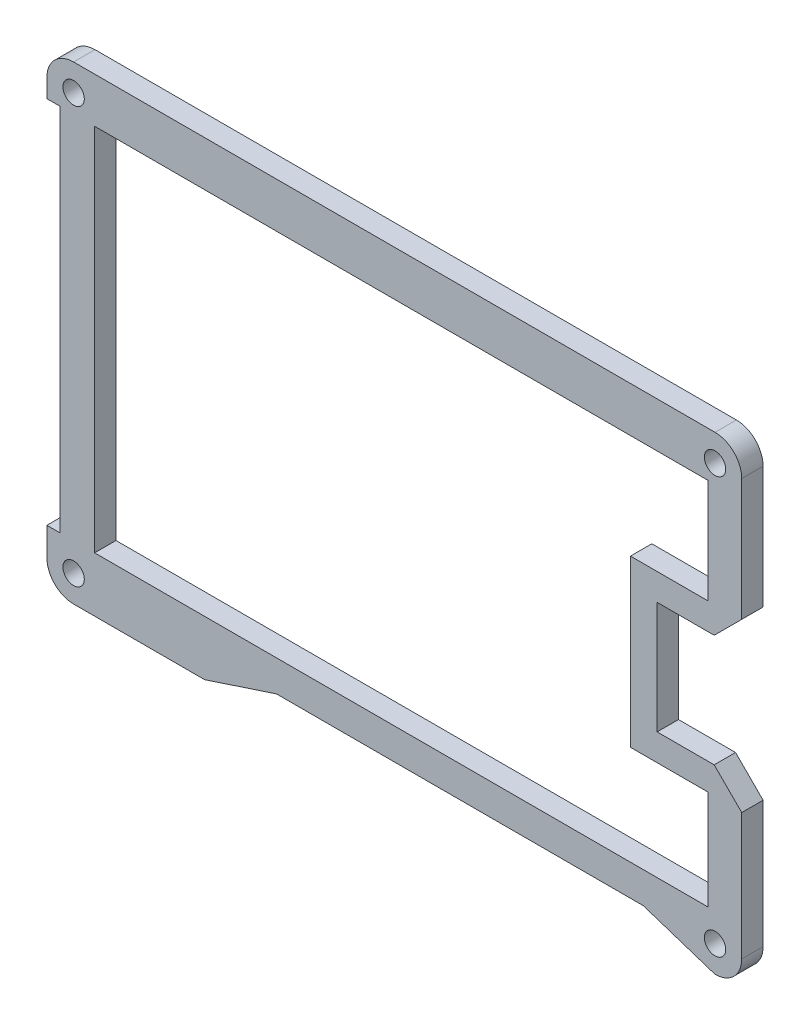
ISO-10303-21;
HEADER;
FILE_DESCRIPTION(('STEP AP214'),'2;1');
FILE_NAME('part.step','',(''),(''),'','','');
FILE_SCHEMA(('AUTOMOTIVE_DESIGN { 1 0 10303 214 1 1 1 1 }'));
ENDSEC;
DATA;
#1=APPLICATION_CONTEXT('core data for automotive mechanical design processes');
#2=APPLICATION_PROTOCOL_DEFINITION('international standard','automotive_design',2000,#1);
#3=PRODUCT_CONTEXT('',#1,'mechanical');
#4=PRODUCT('Part','Part','',(#3));
#5=PRODUCT_RELATED_PRODUCT_CATEGORY('part','',(#4));
#6=PRODUCT_DEFINITION_FORMATION('','',#4);
#7=PRODUCT_DEFINITION_CONTEXT('part definition',#1,'design');
#8=PRODUCT_DEFINITION('design','',#6,#7);
#9=PRODUCT_DEFINITION_SHAPE('','',#8);
#10=(LENGTH_UNIT() NAMED_UNIT(*) SI_UNIT(.MILLI.,.METRE.));
#11=(NAMED_UNIT(*) PLANE_ANGLE_UNIT() SI_UNIT($,.RADIAN.));
#12=(NAMED_UNIT(*) SI_UNIT($,.STERADIAN.) SOLID_ANGLE_UNIT());
#13=UNCERTAINTY_MEASURE_WITH_UNIT(LENGTH_MEASURE(1.E-05),#10,'distance_accuracy_value','');
#14=(GEOMETRIC_REPRESENTATION_CONTEXT(3) GLOBAL_UNCERTAINTY_ASSIGNED_CONTEXT((#13)) GLOBAL_UNIT_ASSIGNED_CONTEXT((#10,
#11,#12)) REPRESENTATION_CONTEXT('',''));
#15=CARTESIAN_POINT('',(0.,0.,0.));
#16=DIRECTION('',(0.,0.,1.));
#17=DIRECTION('',(1.,0.,0.));
#18=AXIS2_PLACEMENT_3D('',#15,#16,#17);
#19=CARTESIAN_POINT('',(-305.7573,91.6317,3.048));
#20=DIRECTION('',(0.,0.,1.));
#21=DIRECTION('',(1.,0.,0.));
#22=AXIS2_PLACEMENT_3D('',#19,#20,#21);
#23=PLANE('',#22);
#24=CARTESIAN_POINT('',(-305.7573,91.6317,3.048));
#25=DIRECTION('',(0.,0.,-1.));
#26=DIRECTION('',(-1.,0.,0.));
#27=AXIS2_PLACEMENT_3D('',#24,#25,#26);
#28=CIRCLE('',#27,1.52400000000001);
#29=CARTESIAN_POINT('',(-307.2813,91.6317,3.048));
#30=VERTEX_POINT('',#29);
#31=EDGE_CURVE('E331',#30,#30,#28,.T.);
#32=ORIENTED_EDGE('',*,*,#31,.T.);
#33=EDGE_LOOP('',(#32));
#34=FACE_BOUND('',#33,.T.);
#35=CARTESIAN_POINT('',(-397.2472,91.6317,3.048));
#36=DIRECTION('',(0.,0.,-1.));
#37=DIRECTION('',(-1.,0.,0.));
#38=AXIS2_PLACEMENT_3D('',#35,#36,#37);
#39=CIRCLE('',#38,1.52400000000001);
#40=CARTESIAN_POINT('',(-398.7712,91.6317,3.048));
#41=VERTEX_POINT('',#40);
#42=EDGE_CURVE('E337',#41,#41,#39,.T.);
#43=ORIENTED_EDGE('',*,*,#42,.T.);
#44=EDGE_LOOP('',(#43));
#45=FACE_BOUND('',#44,.T.);
#46=CARTESIAN_POINT('',(-397.247125,150.9704,3.048));
#47=DIRECTION('',(0.,0.,-1.));
#48=DIRECTION('',(-1.,0.,0.));
#49=AXIS2_PLACEMENT_3D('',#46,#47,#48);
#50=CIRCLE('',#49,1.52400000000001);
#51=CARTESIAN_POINT('',(-398.771125,150.9704,3.048));
#52=VERTEX_POINT('',#51);
#53=EDGE_CURVE('E343',#52,#52,#50,.T.);
#54=ORIENTED_EDGE('',*,*,#53,.T.);
#55=EDGE_LOOP('',(#54));
#56=FACE_BOUND('',#55,.T.);
#57=CARTESIAN_POINT('',(-305.7573,150.9704,3.048));
#58=DIRECTION('',(0.,0.,-1.));
#59=DIRECTION('',(-1.,0.,0.));
#60=AXIS2_PLACEMENT_3D('',#57,#58,#59);
#61=CIRCLE('',#60,1.52400000000001);
#62=CARTESIAN_POINT('',(-307.2813,150.9704,3.048));
#63=VERTEX_POINT('',#62);
#64=EDGE_CURVE('E349',#63,#63,#61,.T.);
#65=ORIENTED_EDGE('',*,*,#64,.T.);
#66=EDGE_LOOP('',(#65));
#67=FACE_BOUND('',#66,.T.);
#68=DIRECTION('',(0.,1.,0.));
#69=VECTOR('',#68,1.);
#70=CARTESIAN_POINT('',(-301.9473,91.6317,3.048));
#71=LINE('',#70,#69);
#72=CARTESIAN_POINT('',(-301.9473,91.6317,3.048));
#73=VERTEX_POINT('',#72);
#74=CARTESIAN_POINT('',(-301.9473,109.71445,3.048));
#75=VERTEX_POINT('',#74);
#76=EDGE_CURVE('E386',#73,#75,#71,.T.);
#77=ORIENTED_EDGE('',*,*,#76,.T.);
#78=DIRECTION('',(0.707106781186548,-0.707106781186548,0.));
#79=VECTOR('',#78,1.);
#80=CARTESIAN_POINT('',(-96.116425,-96.116425,3.048));
#81=LINE('',#80,#79);
#82=CARTESIAN_POINT('',(-305.87795,113.6451,3.048));
#83=VERTEX_POINT('',#82);
#84=EDGE_CURVE('E296',#83,#75,#81,.T.);
#85=ORIENTED_EDGE('',*,*,#84,.F.);
#86=DIRECTION('',(1.,0.,0.));
#87=VECTOR('',#86,1.);
#88=CARTESIAN_POINT('',(0.,113.6451,3.048));
#89=LINE('',#88,#87);
#90=CARTESIAN_POINT('',(-314.0123,113.6451,3.048));
#91=VERTEX_POINT('',#90);
#92=EDGE_CURVE('E311',#91,#83,#89,.T.);
#93=ORIENTED_EDGE('',*,*,#92,.F.);
#94=DIRECTION('',(0.,1.,0.));
#95=VECTOR('',#94,1.);
#96=CARTESIAN_POINT('',(-314.0123,128.8851,3.048));
#97=LINE('',#96,#95);
#98=CARTESIAN_POINT('',(-314.0123,129.6471,3.048));
#99=VERTEX_POINT('',#98);
#100=EDGE_CURVE('E388',#91,#99,#97,.T.);
#101=ORIENTED_EDGE('',*,*,#100,.T.);
#102=DIRECTION('',(-1.,0.,0.));
#103=VECTOR('',#102,1.);
#104=CARTESIAN_POINT('',(0.,129.6471,3.048));
#105=LINE('',#104,#103);
#106=CARTESIAN_POINT('',(-305.87795,129.6471,3.048));
#107=VERTEX_POINT('',#106);
#108=EDGE_CURVE('E308',#107,#99,#105,.T.);
#109=ORIENTED_EDGE('',*,*,#108,.F.);
#110=DIRECTION('',(-0.707106781186548,-0.707106781186548,0.));
#111=VECTOR('',#110,1.);
#112=CARTESIAN_POINT('',(-217.762525,217.762525,3.048));
#113=LINE('',#112,#111);
#114=CARTESIAN_POINT('',(-301.9473,133.57775,3.048));
#115=VERTEX_POINT('',#114);
#116=EDGE_CURVE('E280',#115,#107,#113,.T.);
#117=ORIENTED_EDGE('',*,*,#116,.F.);
#118=DIRECTION('',(0.,1.,0.));
#119=VECTOR('',#118,1.);
#120=CARTESIAN_POINT('',(-301.9473,132.81575,3.048));
#121=LINE('',#120,#119);
#122=CARTESIAN_POINT('',(-301.9473,150.9704,3.048));
#123=VERTEX_POINT('',#122);
#124=EDGE_CURVE('E355',#115,#123,#121,.T.);
#125=ORIENTED_EDGE('',*,*,#124,.T.);
#126=CARTESIAN_POINT('',(-305.7573,150.9704,3.048));
#127=DIRECTION('',(0.,0.,1.));
#128=DIRECTION('',(1.,0.,0.));
#129=AXIS2_PLACEMENT_3D('',#126,#127,#128);
#130=CIRCLE('',#129,3.80999999999997);
#131=CARTESIAN_POINT('',(-305.7573,154.7804,3.048));
#132=VERTEX_POINT('',#131);
#133=EDGE_CURVE('E357',#123,#132,#130,.T.);
#134=ORIENTED_EDGE('',*,*,#133,.T.);
#135=DIRECTION('',(-1.,0.,0.));
#136=VECTOR('',#135,1.);
#137=CARTESIAN_POINT('',(-305.7573,154.7804,3.048));
#138=LINE('',#137,#136);
#139=CARTESIAN_POINT('',(-397.247125,154.7804,3.048));
#140=VERTEX_POINT('',#139);
#141=EDGE_CURVE('E360',#132,#140,#138,.T.);
#142=ORIENTED_EDGE('',*,*,#141,.T.);
#143=CARTESIAN_POINT('',(-397.247125,150.9704,3.048));
#144=DIRECTION('',(0.,0.,1.));
#145=DIRECTION('',(1.,0.,0.));
#146=AXIS2_PLACEMENT_3D('',#143,#144,#145);
#147=CIRCLE('',#146,3.81000000000001);
#148=CARTESIAN_POINT('',(-401.0571,150.956597848903,3.048));
#149=VERTEX_POINT('',#148);
#150=EDGE_CURVE('E362',#140,#149,#147,.T.);
#151=ORIENTED_EDGE('',*,*,#150,.T.);
#152=DIRECTION('',(0.,-1.,0.));
#153=VECTOR('',#152,1.);
#154=CARTESIAN_POINT('',(-401.0571,150.956597848903,3.048));
#155=LINE('',#154,#153);
#156=CARTESIAN_POINT('',(-401.0571,148.341,3.048));
#157=VERTEX_POINT('',#156);
#158=EDGE_CURVE('E364',#149,#157,#155,.T.);
#159=ORIENTED_EDGE('',*,*,#158,.T.);
#160=DIRECTION('',(1.,0.,0.));
#161=VECTOR('',#160,1.);
#162=CARTESIAN_POINT('',(-401.0571,148.341,3.048));
#163=LINE('',#162,#161);
#164=CARTESIAN_POINT('',(-399.1521,148.341,3.048));
#165=VERTEX_POINT('',#164);
#166=EDGE_CURVE('E366',#157,#165,#163,.T.);
#167=ORIENTED_EDGE('',*,*,#166,.T.);
#168=DIRECTION('',(0.,-1.,0.));
#169=VECTOR('',#168,1.);
#170=CARTESIAN_POINT('',(-399.1521,148.341,3.048));
#171=LINE('',#170,#169);
#172=CARTESIAN_POINT('',(-399.1521,95.6449,3.048));
#173=VERTEX_POINT('',#172);
#174=EDGE_CURVE('E368',#165,#173,#171,.T.);
#175=ORIENTED_EDGE('',*,*,#174,.T.);
#176=DIRECTION('',(-1.,0.,0.));
#177=VECTOR('',#176,1.);
#178=CARTESIAN_POINT('',(-399.1521,95.6449,3.048));
#179=LINE('',#178,#177);
#180=CARTESIAN_POINT('',(-401.0571,95.6449,3.048));
#181=VERTEX_POINT('',#180);
#182=EDGE_CURVE('E370',#173,#181,#179,.T.);
#183=ORIENTED_EDGE('',*,*,#182,.T.);
#184=DIRECTION('',(0.,-1.,0.));
#185=VECTOR('',#184,1.);
#186=CARTESIAN_POINT('',(-401.0571,95.6449,3.048));
#187=LINE('',#186,#185);
#188=CARTESIAN_POINT('',(-401.0571,91.6593041663556,3.048));
#189=VERTEX_POINT('',#188);
#190=EDGE_CURVE('E372',#181,#189,#187,.T.);
#191=ORIENTED_EDGE('',*,*,#190,.T.);
#192=CARTESIAN_POINT('',(-397.2472,91.6317,3.048));
#193=DIRECTION('',(0.,0.,1.));
#194=DIRECTION('',(1.,0.,0.));
#195=AXIS2_PLACEMENT_3D('',#192,#193,#194);
#196=CIRCLE('',#195,3.81);
#197=CARTESIAN_POINT('',(-397.2472,87.8217,3.048));
#198=VERTEX_POINT('',#197);
#199=EDGE_CURVE('E374',#189,#198,#196,.T.);
#200=ORIENTED_EDGE('',*,*,#199,.T.);
#201=DIRECTION('',(1.,0.,0.));
#202=VECTOR('',#201,1.);
#203=CARTESIAN_POINT('',(-378.5565,87.8217,3.048));
#204=LINE('',#203,#202);
#205=CARTESIAN_POINT('',(-378.5565,87.8217,3.048));
#206=VERTEX_POINT('',#205);
#207=EDGE_CURVE('E376',#198,#206,#204,.T.);
#208=ORIENTED_EDGE('',*,*,#207,.T.);
#209=DIRECTION('',(0.949975924247208,0.312323139313538,0.));
#210=VECTOR('',#209,1.);
#211=CARTESIAN_POINT('',(-368.3165,91.1883,3.048));
#212=LINE('',#211,#210);
#213=CARTESIAN_POINT('',(-368.3165,91.1883,3.048));
#214=VERTEX_POINT('',#213);
#215=EDGE_CURVE('E378',#206,#214,#212,.T.);
#216=ORIENTED_EDGE('',*,*,#215,.T.);
#217=DIRECTION('',(1.,0.,0.));
#218=VECTOR('',#217,1.);
#219=CARTESIAN_POINT('',(-315.9973,91.1883,3.048));
#220=LINE('',#219,#218);
#221=CARTESIAN_POINT('',(-315.9973,91.1883,3.048));
#222=VERTEX_POINT('',#221);
#223=EDGE_CURVE('E380',#214,#222,#220,.T.);
#224=ORIENTED_EDGE('',*,*,#223,.T.);
#225=DIRECTION('',(0.949975924247207,-0.312323139313541,0.));
#226=VECTOR('',#225,1.);
#227=CARTESIAN_POINT('',(-315.9973,91.1883,3.048));
#228=LINE('',#227,#226);
#229=CARTESIAN_POINT('',(-305.7573,87.8217,3.048));
#230=VERTEX_POINT('',#229);
#231=EDGE_CURVE('E382',#222,#230,#228,.T.);
#232=ORIENTED_EDGE('',*,*,#231,.T.);
#233=CARTESIAN_POINT('',(-305.7573,91.6317,3.048));
#234=DIRECTION('',(0.,0.,1.));
#235=DIRECTION('',(1.,0.,0.));
#236=AXIS2_PLACEMENT_3D('',#233,#234,#235);
#237=CIRCLE('',#236,3.80999999999997);
#238=EDGE_CURVE('E384',#230,#73,#237,.T.);
#239=ORIENTED_EDGE('',*,*,#238,.T.);
#240=EDGE_LOOP('',(#77,#85,#93,#101,#109,#117,#125,#134,#142,#151,#159,#167,#175,#183,#191,#200,
#208,#216,#224,#232,#239));
#241=FACE_BOUND('',#240,.T.);
#242=DIRECTION('',(0.,-1.,0.));
#243=VECTOR('',#242,1.);
#244=CARTESIAN_POINT('',(-306.7733,0.,3.048));
#245=LINE('',#244,#243);
#246=CARTESIAN_POINT('',(-306.7733,148.341,3.048));
#247=VERTEX_POINT('',#246);
#248=CARTESIAN_POINT('',(-306.7733,133.4571,3.048));
#249=VERTEX_POINT('',#248);
#250=EDGE_CURVE('E262',#247,#249,#245,.T.);
#251=ORIENTED_EDGE('',*,*,#250,.T.);
#252=DIRECTION('',(-1.,0.,0.));
#253=VECTOR('',#252,1.);
#254=CARTESIAN_POINT('',(0.,133.4571,3.048));
#255=LINE('',#254,#253);
#256=CARTESIAN_POINT('',(-317.8223,133.4571,3.048));
#257=VERTEX_POINT('',#256);
#258=EDGE_CURVE('E50',#249,#257,#255,.T.);
#259=ORIENTED_EDGE('',*,*,#258,.T.);
#260=DIRECTION('',(0.,-1.,0.));
#261=VECTOR('',#260,1.);
#262=CARTESIAN_POINT('',(-317.8223,0.,3.048));
#263=LINE('',#262,#261);
#264=CARTESIAN_POINT('',(-317.8223,109.8351,3.048));
#265=VERTEX_POINT('',#264);
#266=EDGE_CURVE('E243',#257,#265,#263,.T.);
#267=ORIENTED_EDGE('',*,*,#266,.T.);
#268=DIRECTION('',(1.,0.,0.));
#269=VECTOR('',#268,1.);
#270=CARTESIAN_POINT('',(0.,109.8351,3.048));
#271=LINE('',#270,#269);
#272=CARTESIAN_POINT('',(-306.7733,109.8351,3.048));
#273=VERTEX_POINT('',#272);
#274=EDGE_CURVE('E246',#265,#273,#271,.T.);
#275=ORIENTED_EDGE('',*,*,#274,.T.);
#276=DIRECTION('',(0.,-1.,0.));
#277=VECTOR('',#276,1.);
#278=CARTESIAN_POINT('',(-306.7733,0.,3.048));
#279=LINE('',#278,#277);
#280=CARTESIAN_POINT('',(-306.7733,95.6449,3.048));
#281=VERTEX_POINT('',#280);
#282=EDGE_CURVE('E273',#273,#281,#279,.T.);
#283=ORIENTED_EDGE('',*,*,#282,.T.);
#284=DIRECTION('',(1.,0.,0.));
#285=VECTOR('',#284,1.);
#286=CARTESIAN_POINT('',(0.,95.6449,3.048));
#287=LINE('',#286,#285);
#288=CARTESIAN_POINT('',(-394.2499,95.6449,3.048));
#289=VERTEX_POINT('',#288);
#290=EDGE_CURVE('E270',#289,#281,#287,.T.);
#291=ORIENTED_EDGE('',*,*,#290,.F.);
#292=DIRECTION('',(0.,-1.,0.));
#293=VECTOR('',#292,1.);
#294=CARTESIAN_POINT('',(-394.2499,0.,3.048));
#295=LINE('',#294,#293);
#296=CARTESIAN_POINT('',(-394.2499,148.341,3.048));
#297=VERTEX_POINT('',#296);
#298=EDGE_CURVE('E267',#297,#289,#295,.T.);
#299=ORIENTED_EDGE('',*,*,#298,.F.);
#300=DIRECTION('',(1.,0.,0.));
#301=VECTOR('',#300,1.);
#302=CARTESIAN_POINT('',(0.,148.341,3.048));
#303=LINE('',#302,#301);
#304=EDGE_CURVE('E264',#297,#247,#303,.T.);
#305=ORIENTED_EDGE('',*,*,#304,.T.);
#306=EDGE_LOOP('',(#251,#259,#267,#275,#283,#291,#299,#305));
#307=FACE_BOUND('',#306,.T.);
#308=ADVANCED_FACE('F35',(#34,#45,#56,#67,#241,#307),#23,.T.);
#309=CARTESIAN_POINT('',(-305.7573,91.6317,0.));
#310=DIRECTION('',(0.,0.,1.));
#311=DIRECTION('',(1.,0.,0.));
#312=AXIS2_PLACEMENT_3D('',#309,#310,#311);
#313=PLANE('',#312);
#314=CARTESIAN_POINT('',(-305.7573,91.6317,0.));
#315=DIRECTION('',(0.,0.,-1.));
#316=DIRECTION('',(-1.,0.,0.));
#317=AXIS2_PLACEMENT_3D('',#314,#315,#316);
#318=CIRCLE('',#317,1.52400000000001);
#319=CARTESIAN_POINT('',(-307.2813,91.6317,0.));
#320=VERTEX_POINT('',#319);
#321=EDGE_CURVE('E319',#320,#320,#318,.T.);
#322=ORIENTED_EDGE('',*,*,#321,.F.);
#323=EDGE_LOOP('',(#322));
#324=FACE_BOUND('',#323,.T.);
#325=CARTESIAN_POINT('',(-397.2472,91.6317,0.));
#326=DIRECTION('',(0.,0.,-1.));
#327=DIRECTION('',(-1.,0.,0.));
#328=AXIS2_PLACEMENT_3D('',#325,#326,#327);
#329=CIRCLE('',#328,1.52400000000001);
#330=CARTESIAN_POINT('',(-398.7712,91.6317,0.));
#331=VERTEX_POINT('',#330);
#332=EDGE_CURVE('E334',#331,#331,#329,.T.);
#333=ORIENTED_EDGE('',*,*,#332,.F.);
#334=EDGE_LOOP('',(#333));
#335=FACE_BOUND('',#334,.T.);
#336=CARTESIAN_POINT('',(-397.247125,150.9704,0.));
#337=DIRECTION('',(0.,0.,-1.));
#338=DIRECTION('',(-1.,0.,0.));
#339=AXIS2_PLACEMENT_3D('',#336,#337,#338);
#340=CIRCLE('',#339,1.52400000000001);
#341=CARTESIAN_POINT('',(-398.771125,150.9704,0.));
#342=VERTEX_POINT('',#341);
#343=EDGE_CURVE('E340',#342,#342,#340,.T.);
#344=ORIENTED_EDGE('',*,*,#343,.F.);
#345=EDGE_LOOP('',(#344));
#346=FACE_BOUND('',#345,.T.);
#347=CARTESIAN_POINT('',(-305.7573,150.9704,0.));
#348=DIRECTION('',(0.,0.,-1.));
#349=DIRECTION('',(-1.,0.,0.));
#350=AXIS2_PLACEMENT_3D('',#347,#348,#349);
#351=CIRCLE('',#350,1.52400000000001);
#352=CARTESIAN_POINT('',(-307.2813,150.9704,0.));
#353=VERTEX_POINT('',#352);
#354=EDGE_CURVE('E346',#353,#353,#351,.T.);
#355=ORIENTED_EDGE('',*,*,#354,.F.);
#356=EDGE_LOOP('',(#355));
#357=FACE_BOUND('',#356,.T.);
#358=DIRECTION('',(0.707106781186548,-0.707106781186548,0.));
#359=VECTOR('',#358,1.);
#360=CARTESIAN_POINT('',(-96.116425,-96.116425,0.));
#361=LINE('',#360,#359);
#362=CARTESIAN_POINT('',(-305.87795,113.6451,0.));
#363=VERTEX_POINT('',#362);
#364=CARTESIAN_POINT('',(-301.9473,109.71445,0.));
#365=VERTEX_POINT('',#364);
#366=EDGE_CURVE('E302',#363,#365,#361,.T.);
#367=ORIENTED_EDGE('',*,*,#366,.T.);
#368=DIRECTION('',(0.,1.,0.));
#369=VECTOR('',#368,1.);
#370=CARTESIAN_POINT('',(-301.9473,91.6317,0.));
#371=LINE('',#370,#369);
#372=CARTESIAN_POINT('',(-301.9473,91.6317,0.));
#373=VERTEX_POINT('',#372);
#374=EDGE_CURVE('E420',#373,#365,#371,.T.);
#375=ORIENTED_EDGE('',*,*,#374,.F.);
#376=CARTESIAN_POINT('',(-305.7573,91.6317,0.));
#377=DIRECTION('',(0.,0.,1.));
#378=DIRECTION('',(1.,0.,0.));
#379=AXIS2_PLACEMENT_3D('',#376,#377,#378);
#380=CIRCLE('',#379,3.80999999999997);
#381=CARTESIAN_POINT('',(-305.7573,87.8217,0.));
#382=VERTEX_POINT('',#381);
#383=EDGE_CURVE('E418',#382,#373,#380,.T.);
#384=ORIENTED_EDGE('',*,*,#383,.F.);
#385=DIRECTION('',(0.949975924247207,-0.312323139313541,0.));
#386=VECTOR('',#385,1.);
#387=CARTESIAN_POINT('',(-315.9973,91.1883,0.));
#388=LINE('',#387,#386);
#389=CARTESIAN_POINT('',(-315.9973,91.1883,0.));
#390=VERTEX_POINT('',#389);
#391=EDGE_CURVE('E416',#390,#382,#388,.T.);
#392=ORIENTED_EDGE('',*,*,#391,.F.);
#393=DIRECTION('',(1.,0.,0.));
#394=VECTOR('',#393,1.);
#395=CARTESIAN_POINT('',(-315.9973,91.1883,0.));
#396=LINE('',#395,#394);
#397=CARTESIAN_POINT('',(-368.3165,91.1883,0.));
#398=VERTEX_POINT('',#397);
#399=EDGE_CURVE('E414',#398,#390,#396,.T.);
#400=ORIENTED_EDGE('',*,*,#399,.F.);
#401=DIRECTION('',(0.949975924247208,0.312323139313538,0.));
#402=VECTOR('',#401,1.);
#403=CARTESIAN_POINT('',(-368.3165,91.1883,0.));
#404=LINE('',#403,#402);
#405=CARTESIAN_POINT('',(-378.5565,87.8217,0.));
#406=VERTEX_POINT('',#405);
#407=EDGE_CURVE('E412',#406,#398,#404,.T.);
#408=ORIENTED_EDGE('',*,*,#407,.F.);
#409=DIRECTION('',(1.,0.,0.));
#410=VECTOR('',#409,1.);
#411=CARTESIAN_POINT('',(-378.5565,87.8217,0.));
#412=LINE('',#411,#410);
#413=CARTESIAN_POINT('',(-397.2472,87.8217,0.));
#414=VERTEX_POINT('',#413);
#415=EDGE_CURVE('E410',#414,#406,#412,.T.);
#416=ORIENTED_EDGE('',*,*,#415,.F.);
#417=CARTESIAN_POINT('',(-397.2472,91.6317,0.));
#418=DIRECTION('',(0.,0.,1.));
#419=DIRECTION('',(1.,0.,0.));
#420=AXIS2_PLACEMENT_3D('',#417,#418,#419);
#421=CIRCLE('',#420,3.81);
#422=CARTESIAN_POINT('',(-401.0571,91.6593041663556,0.));
#423=VERTEX_POINT('',#422);
#424=EDGE_CURVE('E408',#423,#414,#421,.T.);
#425=ORIENTED_EDGE('',*,*,#424,.F.);
#426=DIRECTION('',(0.,-1.,0.));
#427=VECTOR('',#426,1.);
#428=CARTESIAN_POINT('',(-401.0571,95.6449,0.));
#429=LINE('',#428,#427);
#430=CARTESIAN_POINT('',(-401.0571,95.6449,0.));
#431=VERTEX_POINT('',#430);
#432=EDGE_CURVE('E406',#431,#423,#429,.T.);
#433=ORIENTED_EDGE('',*,*,#432,.F.);
#434=DIRECTION('',(-1.,0.,0.));
#435=VECTOR('',#434,1.);
#436=CARTESIAN_POINT('',(-399.1521,95.6449,0.));
#437=LINE('',#436,#435);
#438=CARTESIAN_POINT('',(-399.1521,95.6449,0.));
#439=VERTEX_POINT('',#438);
#440=EDGE_CURVE('E404',#439,#431,#437,.T.);
#441=ORIENTED_EDGE('',*,*,#440,.F.);
#442=DIRECTION('',(0.,-1.,0.));
#443=VECTOR('',#442,1.);
#444=CARTESIAN_POINT('',(-399.1521,148.341,0.));
#445=LINE('',#444,#443);
#446=CARTESIAN_POINT('',(-399.1521,148.341,0.));
#447=VERTEX_POINT('',#446);
#448=EDGE_CURVE('E402',#447,#439,#445,.T.);
#449=ORIENTED_EDGE('',*,*,#448,.F.);
#450=DIRECTION('',(1.,0.,0.));
#451=VECTOR('',#450,1.);
#452=CARTESIAN_POINT('',(-401.0571,148.341,0.));
#453=LINE('',#452,#451);
#454=CARTESIAN_POINT('',(-401.0571,148.341,0.));
#455=VERTEX_POINT('',#454);
#456=EDGE_CURVE('E400',#455,#447,#453,.T.);
#457=ORIENTED_EDGE('',*,*,#456,.F.);
#458=DIRECTION('',(0.,-1.,0.));
#459=VECTOR('',#458,1.);
#460=CARTESIAN_POINT('',(-401.0571,150.956597848903,0.));
#461=LINE('',#460,#459);
#462=CARTESIAN_POINT('',(-401.0571,150.956597848903,0.));
#463=VERTEX_POINT('',#462);
#464=EDGE_CURVE('E398',#463,#455,#461,.T.);
#465=ORIENTED_EDGE('',*,*,#464,.F.);
#466=CARTESIAN_POINT('',(-397.247125,150.9704,0.));
#467=DIRECTION('',(0.,0.,1.));
#468=DIRECTION('',(1.,0.,0.));
#469=AXIS2_PLACEMENT_3D('',#466,#467,#468);
#470=CIRCLE('',#469,3.81000000000001);
#471=CARTESIAN_POINT('',(-397.247125,154.7804,0.));
#472=VERTEX_POINT('',#471);
#473=EDGE_CURVE('E396',#472,#463,#470,.T.);
#474=ORIENTED_EDGE('',*,*,#473,.F.);
#475=DIRECTION('',(-1.,0.,0.));
#476=VECTOR('',#475,1.);
#477=CARTESIAN_POINT('',(-305.7573,154.7804,0.));
#478=LINE('',#477,#476);
#479=CARTESIAN_POINT('',(-305.7573,154.7804,0.));
#480=VERTEX_POINT('',#479);
#481=EDGE_CURVE('E394',#480,#472,#478,.T.);
#482=ORIENTED_EDGE('',*,*,#481,.F.);
#483=CARTESIAN_POINT('',(-305.7573,150.9704,0.));
#484=DIRECTION('',(0.,0.,1.));
#485=DIRECTION('',(1.,0.,0.));
#486=AXIS2_PLACEMENT_3D('',#483,#484,#485);
#487=CIRCLE('',#486,3.80999999999997);
#488=CARTESIAN_POINT('',(-301.9473,150.9704,0.));
#489=VERTEX_POINT('',#488);
#490=EDGE_CURVE('E392',#489,#480,#487,.T.);
#491=ORIENTED_EDGE('',*,*,#490,.F.);
#492=DIRECTION('',(0.,1.,0.));
#493=VECTOR('',#492,1.);
#494=CARTESIAN_POINT('',(-301.9473,132.81575,0.));
#495=LINE('',#494,#493);
#496=CARTESIAN_POINT('',(-301.9473,133.57775,0.));
#497=VERTEX_POINT('',#496);
#498=EDGE_CURVE('E352',#497,#489,#495,.T.);
#499=ORIENTED_EDGE('',*,*,#498,.F.);
#500=DIRECTION('',(-0.707106781186548,-0.707106781186548,0.));
#501=VECTOR('',#500,1.);
#502=CARTESIAN_POINT('',(-217.762525,217.762525,0.));
#503=LINE('',#502,#501);
#504=CARTESIAN_POINT('',(-305.87795,129.6471,0.));
#505=VERTEX_POINT('',#504);
#506=EDGE_CURVE('E292',#497,#505,#503,.T.);
#507=ORIENTED_EDGE('',*,*,#506,.T.);
#508=DIRECTION('',(-1.,0.,0.));
#509=VECTOR('',#508,1.);
#510=CARTESIAN_POINT('',(0.,129.6471,0.));
#511=LINE('',#510,#509);
#512=CARTESIAN_POINT('',(-314.0123,129.6471,0.));
#513=VERTEX_POINT('',#512);
#514=EDGE_CURVE('E295',#505,#513,#511,.T.);
#515=ORIENTED_EDGE('',*,*,#514,.T.);
#516=DIRECTION('',(0.,1.,0.));
#517=VECTOR('',#516,1.);
#518=CARTESIAN_POINT('',(-314.0123,128.8851,0.));
#519=LINE('',#518,#517);
#520=CARTESIAN_POINT('',(-314.0123,113.6451,0.));
#521=VERTEX_POINT('',#520);
#522=EDGE_CURVE('E358',#521,#513,#519,.T.);
#523=ORIENTED_EDGE('',*,*,#522,.F.);
#524=DIRECTION('',(1.,0.,0.));
#525=VECTOR('',#524,1.);
#526=CARTESIAN_POINT('',(0.,113.6451,0.));
#527=LINE('',#526,#525);
#528=EDGE_CURVE('E299',#521,#363,#527,.T.);
#529=ORIENTED_EDGE('',*,*,#528,.T.);
#530=EDGE_LOOP('',(#367,#375,#384,#392,#400,#408,#416,#425,#433,#441,#449,#457,#465,#474,#482,
#491,#499,#507,#515,#523,#529));
#531=FACE_BOUND('',#530,.T.);
#532=DIRECTION('',(-1.,0.,0.));
#533=VECTOR('',#532,1.);
#534=CARTESIAN_POINT('',(0.,133.4571,0.));
#535=LINE('',#534,#533);
#536=CARTESIAN_POINT('',(-306.7733,133.4571,0.));
#537=VERTEX_POINT('',#536);
#538=CARTESIAN_POINT('',(-317.8223,133.4571,0.));
#539=VERTEX_POINT('',#538);
#540=EDGE_CURVE('E234',#537,#539,#535,.T.);
#541=ORIENTED_EDGE('',*,*,#540,.F.);
#542=DIRECTION('',(0.,-1.,0.));
#543=VECTOR('',#542,1.);
#544=CARTESIAN_POINT('',(-306.7733,0.,0.));
#545=LINE('',#544,#543);
#546=CARTESIAN_POINT('',(-306.7733,148.341,0.));
#547=VERTEX_POINT('',#546);
#548=EDGE_CURVE('E226',#547,#537,#545,.T.);
#549=ORIENTED_EDGE('',*,*,#548,.F.);
#550=DIRECTION('',(1.,0.,0.));
#551=VECTOR('',#550,1.);
#552=CARTESIAN_POINT('',(0.,148.341,0.));
#553=LINE('',#552,#551);
#554=CARTESIAN_POINT('',(-394.2499,148.341,0.));
#555=VERTEX_POINT('',#554);
#556=EDGE_CURVE('E233',#555,#547,#553,.T.);
#557=ORIENTED_EDGE('',*,*,#556,.F.);
#558=DIRECTION('',(0.,-1.,0.));
#559=VECTOR('',#558,1.);
#560=CARTESIAN_POINT('',(-394.2499,0.,0.));
#561=LINE('',#560,#559);
#562=CARTESIAN_POINT('',(-394.2499,95.6449,0.));
#563=VERTEX_POINT('',#562);
#564=EDGE_CURVE('E250',#555,#563,#561,.T.);
#565=ORIENTED_EDGE('',*,*,#564,.T.);
#566=DIRECTION('',(1.,0.,0.));
#567=VECTOR('',#566,1.);
#568=CARTESIAN_POINT('',(0.,95.6449,0.));
#569=LINE('',#568,#567);
#570=CARTESIAN_POINT('',(-306.7733,95.6449,0.));
#571=VERTEX_POINT('',#570);
#572=EDGE_CURVE('E253',#563,#571,#569,.T.);
#573=ORIENTED_EDGE('',*,*,#572,.T.);
#574=DIRECTION('',(0.,-1.,0.));
#575=VECTOR('',#574,1.);
#576=CARTESIAN_POINT('',(-306.7733,0.,0.));
#577=LINE('',#576,#575);
#578=CARTESIAN_POINT('',(-306.7733,109.8351,0.));
#579=VERTEX_POINT('',#578);
#580=EDGE_CURVE('E256',#579,#571,#577,.T.);
#581=ORIENTED_EDGE('',*,*,#580,.F.);
#582=DIRECTION('',(1.,0.,0.));
#583=VECTOR('',#582,1.);
#584=CARTESIAN_POINT('',(0.,109.8351,0.));
#585=LINE('',#584,#583);
#586=CARTESIAN_POINT('',(-317.8223,109.8351,0.));
#587=VERTEX_POINT('',#586);
#588=EDGE_CURVE('E258',#587,#579,#585,.T.);
#589=ORIENTED_EDGE('',*,*,#588,.F.);
#590=DIRECTION('',(0.,-1.,0.));
#591=VECTOR('',#590,1.);
#592=CARTESIAN_POINT('',(-317.8223,0.,0.));
#593=LINE('',#592,#591);
#594=EDGE_CURVE('E238',#539,#587,#593,.T.);
#595=ORIENTED_EDGE('',*,*,#594,.F.);
#596=EDGE_LOOP('',(#541,#549,#557,#565,#573,#581,#589,#595));
#597=FACE_BOUND('',#596,.T.);
#598=ADVANCED_FACE('F241',(#324,#335,#346,#357,#531,#597),#313,.F.);
#599=CARTESIAN_POINT('',(-301.9473,132.81575,3.048));
#600=DIRECTION('',(-1.,0.,0.));
#601=DIRECTION('',(0.,0.,1.));
#602=AXIS2_PLACEMENT_3D('',#599,#600,#601);
#603=PLANE('',#602);
#604=DIRECTION('',(0.,0.,-1.));
#605=VECTOR('',#604,1.);
#606=CARTESIAN_POINT('',(-301.9473,150.9704,3.048));
#607=LINE('',#606,#605);
#608=EDGE_CURVE('E11',#123,#489,#607,.T.);
#609=ORIENTED_EDGE('',*,*,#608,.F.);
#610=ORIENTED_EDGE('',*,*,#124,.F.);
#611=DIRECTION('',(0.,0.,1.));
#612=VECTOR('',#611,1.);
#613=CARTESIAN_POINT('',(-301.9473,133.57775,0.));
#614=LINE('',#613,#612);
#615=EDGE_CURVE('E305',#497,#115,#614,.T.);
#616=ORIENTED_EDGE('',*,*,#615,.F.);
#617=ORIENTED_EDGE('',*,*,#498,.T.);
#618=EDGE_LOOP('',(#609,#610,#616,#617));
#619=FACE_BOUND('',#618,.T.);
#620=ADVANCED_FACE('F37',(#619),#603,.F.);
#621=CARTESIAN_POINT('',(-305.7573,150.9704,3.048));
#622=DIRECTION('',(0.,0.,-1.));
#623=DIRECTION('',(-1.,0.,0.));
#624=AXIS2_PLACEMENT_3D('',#621,#622,#623);
#625=CYLINDRICAL_SURFACE('',#624,3.80999999999997);
#626=ORIENTED_EDGE('',*,*,#490,.T.);
#627=DIRECTION('',(0.,0.,-1.));
#628=VECTOR('',#627,1.);
#629=CARTESIAN_POINT('',(-305.7573,154.7804,3.048));
#630=LINE('',#629,#628);
#631=EDGE_CURVE('E43',#132,#480,#630,.T.);
#632=ORIENTED_EDGE('',*,*,#631,.F.);
#633=ORIENTED_EDGE('',*,*,#133,.F.);
#634=ORIENTED_EDGE('',*,*,#608,.T.);
#635=EDGE_LOOP('',(#626,#632,#633,#634));
#636=FACE_BOUND('',#635,.T.);
#637=ADVANCED_FACE('F490',(#636),#625,.T.);
#638=CARTESIAN_POINT('',(-305.7573,154.7804,3.048));
#639=DIRECTION('',(0.,-1.,0.));
#640=DIRECTION('',(0.,0.,-1.));
#641=AXIS2_PLACEMENT_3D('',#638,#639,#640);
#642=PLANE('',#641);
#643=ORIENTED_EDGE('',*,*,#481,.T.);
#644=DIRECTION('',(0.,0.,-1.));
#645=VECTOR('',#644,1.);
#646=CARTESIAN_POINT('',(-397.247125,154.7804,3.048));
#647=LINE('',#646,#645);
#648=EDGE_CURVE('E458',#140,#472,#647,.T.);
#649=ORIENTED_EDGE('',*,*,#648,.F.);
#650=ORIENTED_EDGE('',*,*,#141,.F.);
#651=ORIENTED_EDGE('',*,*,#631,.T.);
#652=EDGE_LOOP('',(#643,#649,#650,#651));
#653=FACE_BOUND('',#652,.T.);
#654=ADVANCED_FACE('F465',(#653),#642,.F.);
#655=CARTESIAN_POINT('',(-397.247125,150.9704,3.048));
#656=DIRECTION('',(0.,0.,-1.));
#657=DIRECTION('',(-1.,0.,0.));
#658=AXIS2_PLACEMENT_3D('',#655,#656,#657);
#659=CYLINDRICAL_SURFACE('',#658,3.81000000000001);
#660=ORIENTED_EDGE('',*,*,#473,.T.);
#661=DIRECTION('',(0.,0.,-1.));
#662=VECTOR('',#661,1.);
#663=CARTESIAN_POINT('',(-401.0571,150.956597848903,3.048));
#664=LINE('',#663,#662);
#665=EDGE_CURVE('E455',#149,#463,#664,.T.);
#666=ORIENTED_EDGE('',*,*,#665,.F.);
#667=ORIENTED_EDGE('',*,*,#150,.F.);
#668=ORIENTED_EDGE('',*,*,#648,.T.);
#669=EDGE_LOOP('',(#660,#666,#667,#668));
#670=FACE_BOUND('',#669,.T.);
#671=ADVANCED_FACE('F477',(#670),#659,.T.);
#672=CARTESIAN_POINT('',(-401.0571,150.956597848903,3.048));
#673=DIRECTION('',(1.,0.,0.));
#674=DIRECTION('',(0.,0.,-1.));
#675=AXIS2_PLACEMENT_3D('',#672,#673,#674);
#676=PLANE('',#675);
#677=ORIENTED_EDGE('',*,*,#464,.T.);
#678=DIRECTION('',(0.,0.,-1.));
#679=VECTOR('',#678,1.);
#680=CARTESIAN_POINT('',(-401.0571,148.341,3.048));
#681=LINE('',#680,#679);
#682=EDGE_CURVE('E452',#157,#455,#681,.T.);
#683=ORIENTED_EDGE('',*,*,#682,.F.);
#684=ORIENTED_EDGE('',*,*,#158,.F.);
#685=ORIENTED_EDGE('',*,*,#665,.T.);
#686=EDGE_LOOP('',(#677,#683,#684,#685));
#687=FACE_BOUND('',#686,.T.);
#688=ADVANCED_FACE('F481',(#687),#676,.F.);
#689=CARTESIAN_POINT('',(-401.0571,148.341,3.048));
#690=DIRECTION('',(0.,1.,0.));
#691=DIRECTION('',(0.,0.,1.));
#692=AXIS2_PLACEMENT_3D('',#689,#690,#691);
#693=PLANE('',#692);
#694=ORIENTED_EDGE('',*,*,#456,.T.);
#695=DIRECTION('',(0.,0.,-1.));
#696=VECTOR('',#695,1.);
#697=CARTESIAN_POINT('',(-399.1521,148.341,3.048));
#698=LINE('',#697,#696);
#699=EDGE_CURVE('E449',#165,#447,#698,.T.);
#700=ORIENTED_EDGE('',*,*,#699,.F.);
#701=ORIENTED_EDGE('',*,*,#166,.F.);
#702=ORIENTED_EDGE('',*,*,#682,.T.);
#703=EDGE_LOOP('',(#694,#700,#701,#702));
#704=FACE_BOUND('',#703,.T.);
#705=ADVANCED_FACE('F562',(#704),#693,.F.);
#706=CARTESIAN_POINT('',(-399.1521,148.341,3.048));
#707=DIRECTION('',(1.,0.,0.));
#708=DIRECTION('',(0.,0.,-1.));
#709=AXIS2_PLACEMENT_3D('',#706,#707,#708);
#710=PLANE('',#709);
#711=ORIENTED_EDGE('',*,*,#448,.T.);
#712=DIRECTION('',(0.,0.,-1.));
#713=VECTOR('',#712,1.);
#714=CARTESIAN_POINT('',(-399.1521,95.6449,3.048));
#715=LINE('',#714,#713);
#716=EDGE_CURVE('E446',#173,#439,#715,.T.);
#717=ORIENTED_EDGE('',*,*,#716,.F.);
#718=ORIENTED_EDGE('',*,*,#174,.F.);
#719=ORIENTED_EDGE('',*,*,#699,.T.);
#720=EDGE_LOOP('',(#711,#717,#718,#719));
#721=FACE_BOUND('',#720,.T.);
#722=ADVANCED_FACE('F560',(#721),#710,.F.);
#723=CARTESIAN_POINT('',(-399.1521,95.6449,3.048));
#724=DIRECTION('',(0.,-1.,0.));
#725=DIRECTION('',(0.,0.,-1.));
#726=AXIS2_PLACEMENT_3D('',#723,#724,#725);
#727=PLANE('',#726);
#728=ORIENTED_EDGE('',*,*,#440,.T.);
#729=DIRECTION('',(0.,0.,-1.));
#730=VECTOR('',#729,1.);
#731=CARTESIAN_POINT('',(-401.0571,95.6449,3.048));
#732=LINE('',#731,#730);
#733=EDGE_CURVE('E443',#181,#431,#732,.T.);
#734=ORIENTED_EDGE('',*,*,#733,.F.);
#735=ORIENTED_EDGE('',*,*,#182,.F.);
#736=ORIENTED_EDGE('',*,*,#716,.T.);
#737=EDGE_LOOP('',(#728,#734,#735,#736));
#738=FACE_BOUND('',#737,.T.);
#739=ADVANCED_FACE('F556',(#738),#727,.F.);
#740=CARTESIAN_POINT('',(-401.0571,95.6449,3.048));
#741=DIRECTION('',(1.,0.,0.));
#742=DIRECTION('',(0.,0.,-1.));
#743=AXIS2_PLACEMENT_3D('',#740,#741,#742);
#744=PLANE('',#743);
#745=ORIENTED_EDGE('',*,*,#432,.T.);
#746=DIRECTION('',(0.,0.,-1.));
#747=VECTOR('',#746,1.);
#748=CARTESIAN_POINT('',(-401.0571,91.6593041663556,3.048));
#749=LINE('',#748,#747);
#750=EDGE_CURVE('E440',#189,#423,#749,.T.);
#751=ORIENTED_EDGE('',*,*,#750,.F.);
#752=ORIENTED_EDGE('',*,*,#190,.F.);
#753=ORIENTED_EDGE('',*,*,#733,.T.);
#754=EDGE_LOOP('',(#745,#751,#752,#753));
#755=FACE_BOUND('',#754,.T.);
#756=ADVANCED_FACE('F551',(#755),#744,.F.);
#757=CARTESIAN_POINT('',(-397.2472,91.6317,3.048));
#758=DIRECTION('',(0.,0.,-1.));
#759=DIRECTION('',(-1.,0.,0.));
#760=AXIS2_PLACEMENT_3D('',#757,#758,#759);
#761=CYLINDRICAL_SURFACE('',#760,3.81);
#762=ORIENTED_EDGE('',*,*,#424,.T.);
#763=DIRECTION('',(0.,0.,-1.));
#764=VECTOR('',#763,1.);
#765=CARTESIAN_POINT('',(-397.2472,87.8217,3.048));
#766=LINE('',#765,#764);
#767=EDGE_CURVE('E437',#198,#414,#766,.T.);
#768=ORIENTED_EDGE('',*,*,#767,.F.);
#769=ORIENTED_EDGE('',*,*,#199,.F.);
#770=ORIENTED_EDGE('',*,*,#750,.T.);
#771=EDGE_LOOP('',(#762,#768,#769,#770));
#772=FACE_BOUND('',#771,.T.);
#773=ADVANCED_FACE('F545',(#772),#761,.T.);
#774=CARTESIAN_POINT('',(-378.5565,87.8217,3.048));
#775=DIRECTION('',(0.,1.,0.));
#776=DIRECTION('',(0.,0.,1.));
#777=AXIS2_PLACEMENT_3D('',#774,#775,#776);
#778=PLANE('',#777);
#779=ORIENTED_EDGE('',*,*,#415,.T.);
#780=DIRECTION('',(0.,0.,-1.));
#781=VECTOR('',#780,1.);
#782=CARTESIAN_POINT('',(-378.5565,87.8217,3.048));
#783=LINE('',#782,#781);
#784=EDGE_CURVE('E434',#206,#406,#783,.T.);
#785=ORIENTED_EDGE('',*,*,#784,.F.);
#786=ORIENTED_EDGE('',*,*,#207,.F.);
#787=ORIENTED_EDGE('',*,*,#767,.T.);
#788=EDGE_LOOP('',(#779,#785,#786,#787));
#789=FACE_BOUND('',#788,.T.);
#790=ADVANCED_FACE('F541',(#789),#778,.F.);
#791=CARTESIAN_POINT('',(-368.3165,91.1883,3.048));
#792=DIRECTION('',(-0.312323139313538,0.949975924247208,0.));
#793=DIRECTION('',(-0.949975924247208,-0.312323139313538,0.));
#794=AXIS2_PLACEMENT_3D('',#791,#792,#793);
#795=PLANE('',#794);
#796=ORIENTED_EDGE('',*,*,#407,.T.);
#797=DIRECTION('',(0.,0.,-1.));
#798=VECTOR('',#797,1.);
#799=CARTESIAN_POINT('',(-368.3165,91.1883,3.048));
#800=LINE('',#799,#798);
#801=EDGE_CURVE('E431',#214,#398,#800,.T.);
#802=ORIENTED_EDGE('',*,*,#801,.F.);
#803=ORIENTED_EDGE('',*,*,#215,.F.);
#804=ORIENTED_EDGE('',*,*,#784,.T.);
#805=EDGE_LOOP('',(#796,#802,#803,#804));
#806=FACE_BOUND('',#805,.T.);
#807=ADVANCED_FACE('F536',(#806),#795,.F.);
#808=CARTESIAN_POINT('',(-315.9973,91.1883,3.048));
#809=DIRECTION('',(0.,1.,0.));
#810=DIRECTION('',(-1.,0.,0.));
#811=AXIS2_PLACEMENT_3D('',#808,#809,#810);
#812=PLANE('',#811);
#813=ORIENTED_EDGE('',*,*,#399,.T.);
#814=DIRECTION('',(0.,0.,-1.));
#815=VECTOR('',#814,1.);
#816=CARTESIAN_POINT('',(-315.9973,91.1883,3.048));
#817=LINE('',#816,#815);
#818=EDGE_CURVE('E428',#222,#390,#817,.T.);
#819=ORIENTED_EDGE('',*,*,#818,.F.);
#820=ORIENTED_EDGE('',*,*,#223,.F.);
#821=ORIENTED_EDGE('',*,*,#801,.T.);
#822=EDGE_LOOP('',(#813,#819,#820,#821));
#823=FACE_BOUND('',#822,.T.);
#824=ADVANCED_FACE('F530',(#823),#812,.F.);
#825=CARTESIAN_POINT('',(-315.9973,91.1883,3.048));
#826=DIRECTION('',(0.312323139313541,0.949975924247206,0.));
#827=DIRECTION('',(-0.949975924247207,0.312323139313541,0.));
#828=AXIS2_PLACEMENT_3D('',#825,#826,#827);
#829=PLANE('',#828);
#830=ORIENTED_EDGE('',*,*,#391,.T.);
#831=DIRECTION('',(0.,0.,-1.));
#832=VECTOR('',#831,1.);
#833=CARTESIAN_POINT('',(-305.7573,87.8217,3.048));
#834=LINE('',#833,#832);
#835=EDGE_CURVE('E425',#230,#382,#834,.T.);
#836=ORIENTED_EDGE('',*,*,#835,.F.);
#837=ORIENTED_EDGE('',*,*,#231,.F.);
#838=ORIENTED_EDGE('',*,*,#818,.T.);
#839=EDGE_LOOP('',(#830,#836,#837,#838));
#840=FACE_BOUND('',#839,.T.);
#841=ADVANCED_FACE('F526',(#840),#829,.F.);
#842=CARTESIAN_POINT('',(-305.7573,91.6317,3.048));
#843=DIRECTION('',(0.,0.,-1.));
#844=DIRECTION('',(-1.,0.,0.));
#845=AXIS2_PLACEMENT_3D('',#842,#843,#844);
#846=CYLINDRICAL_SURFACE('',#845,3.80999999999997);
#847=ORIENTED_EDGE('',*,*,#383,.T.);
#848=DIRECTION('',(0.,0.,-1.));
#849=VECTOR('',#848,1.);
#850=CARTESIAN_POINT('',(-301.9473,91.6317,3.048));
#851=LINE('',#850,#849);
#852=EDGE_CURVE('E390',#73,#373,#851,.T.);
#853=ORIENTED_EDGE('',*,*,#852,.F.);
#854=ORIENTED_EDGE('',*,*,#238,.F.);
#855=ORIENTED_EDGE('',*,*,#835,.T.);
#856=EDGE_LOOP('',(#847,#853,#854,#855));
#857=FACE_BOUND('',#856,.T.);
#858=ADVANCED_FACE('F521',(#857),#846,.T.);
#859=CARTESIAN_POINT('',(-301.9473,91.6317,3.048));
#860=DIRECTION('',(-1.,0.,0.));
#861=DIRECTION('',(0.,0.,1.));
#862=AXIS2_PLACEMENT_3D('',#859,#860,#861);
#863=PLANE('',#862);
#864=ORIENTED_EDGE('',*,*,#374,.T.);
#865=DIRECTION('',(0.,0.,1.));
#866=VECTOR('',#865,1.);
#867=CARTESIAN_POINT('',(-301.9473,109.71445,0.));
#868=LINE('',#867,#866);
#869=EDGE_CURVE('E316',#365,#75,#868,.T.);
#870=ORIENTED_EDGE('',*,*,#869,.T.);
#871=ORIENTED_EDGE('',*,*,#76,.F.);
#872=ORIENTED_EDGE('',*,*,#852,.T.);
#873=EDGE_LOOP('',(#864,#870,#871,#872));
#874=FACE_BOUND('',#873,.T.);
#875=ADVANCED_FACE('F515',(#874),#863,.F.);
#876=CARTESIAN_POINT('',(-314.0123,128.8851,3.048));
#877=DIRECTION('',(-1.,0.,0.));
#878=DIRECTION('',(0.,0.,1.));
#879=AXIS2_PLACEMENT_3D('',#876,#877,#878);
#880=PLANE('',#879);
#881=ORIENTED_EDGE('',*,*,#522,.T.);
#882=DIRECTION('',(0.,0.,1.));
#883=VECTOR('',#882,1.);
#884=CARTESIAN_POINT('',(-314.0123,129.6471,0.));
#885=LINE('',#884,#883);
#886=EDGE_CURVE('E325',#513,#99,#885,.T.);
#887=ORIENTED_EDGE('',*,*,#886,.T.);
#888=ORIENTED_EDGE('',*,*,#100,.F.);
#889=DIRECTION('',(0.,0.,1.));
#890=VECTOR('',#889,1.);
#891=CARTESIAN_POINT('',(-314.0123,113.6451,0.));
#892=LINE('',#891,#890);
#893=EDGE_CURVE('E322',#521,#91,#892,.T.);
#894=ORIENTED_EDGE('',*,*,#893,.F.);
#895=EDGE_LOOP('',(#881,#887,#888,#894));
#896=FACE_BOUND('',#895,.T.);
#897=ADVANCED_FACE('F501',(#896),#880,.F.);
#898=CARTESIAN_POINT('',(-305.7573,150.9704,3.048));
#899=DIRECTION('',(0.,0.,-1.));
#900=DIRECTION('',(-1.,0.,0.));
#901=AXIS2_PLACEMENT_3D('',#898,#899,#900);
#902=CYLINDRICAL_SURFACE('',#901,1.52400000000001);
#903=ORIENTED_EDGE('',*,*,#64,.F.);
#904=EDGE_LOOP('',(#903));
#905=FACE_BOUND('',#904,.T.);
#906=ORIENTED_EDGE('',*,*,#354,.T.);
#907=EDGE_LOOP('',(#906));
#908=FACE_BOUND('',#907,.T.);
#909=ADVANCED_FACE('F582',(#905,#908),#902,.F.);
#910=CARTESIAN_POINT('',(-397.247125,150.9704,3.048));
#911=DIRECTION('',(0.,0.,-1.));
#912=DIRECTION('',(-1.,0.,0.));
#913=AXIS2_PLACEMENT_3D('',#910,#911,#912);
#914=CYLINDRICAL_SURFACE('',#913,1.52400000000001);
#915=ORIENTED_EDGE('',*,*,#53,.F.);
#916=EDGE_LOOP('',(#915));
#917=FACE_BOUND('',#916,.T.);
#918=ORIENTED_EDGE('',*,*,#343,.T.);
#919=EDGE_LOOP('',(#918));
#920=FACE_BOUND('',#919,.T.);
#921=ADVANCED_FACE('F652',(#917,#920),#914,.F.);
#922=CARTESIAN_POINT('',(-397.2472,91.6317,3.048));
#923=DIRECTION('',(0.,0.,-1.));
#924=DIRECTION('',(-1.,0.,0.));
#925=AXIS2_PLACEMENT_3D('',#922,#923,#924);
#926=CYLINDRICAL_SURFACE('',#925,1.52400000000001);
#927=ORIENTED_EDGE('',*,*,#42,.F.);
#928=EDGE_LOOP('',(#927));
#929=FACE_BOUND('',#928,.T.);
#930=ORIENTED_EDGE('',*,*,#332,.T.);
#931=EDGE_LOOP('',(#930));
#932=FACE_BOUND('',#931,.T.);
#933=ADVANCED_FACE('F659',(#929,#932),#926,.F.);
#934=CARTESIAN_POINT('',(-305.7573,91.6317,3.048));
#935=DIRECTION('',(0.,0.,-1.));
#936=DIRECTION('',(-1.,0.,0.));
#937=AXIS2_PLACEMENT_3D('',#934,#935,#936);
#938=CYLINDRICAL_SURFACE('',#937,1.52400000000001);
#939=ORIENTED_EDGE('',*,*,#31,.F.);
#940=EDGE_LOOP('',(#939));
#941=FACE_BOUND('',#940,.T.);
#942=ORIENTED_EDGE('',*,*,#321,.T.);
#943=EDGE_LOOP('',(#942));
#944=FACE_BOUND('',#943,.T.);
#945=ADVANCED_FACE('F666',(#941,#944),#938,.F.);
#946=CARTESIAN_POINT('',(-96.116425,-96.116425,0.));
#947=DIRECTION('',(-0.707106781186547,-0.707106781186547,0.));
#948=DIRECTION('',(0.707106781186548,-0.707106781186548,0.));
#949=AXIS2_PLACEMENT_3D('',#946,#947,#948);
#950=PLANE('',#949);
#951=ORIENTED_EDGE('',*,*,#84,.T.);
#952=ORIENTED_EDGE('',*,*,#869,.F.);
#953=ORIENTED_EDGE('',*,*,#366,.F.);
#954=DIRECTION('',(0.,0.,1.));
#955=VECTOR('',#954,1.);
#956=CARTESIAN_POINT('',(-305.87795,113.6451,0.));
#957=LINE('',#956,#955);
#958=EDGE_CURVE('E320',#363,#83,#957,.T.);
#959=ORIENTED_EDGE('',*,*,#958,.T.);
#960=EDGE_LOOP('',(#951,#952,#953,#959));
#961=FACE_BOUND('',#960,.T.);
#962=ADVANCED_FACE('F512',(#961),#950,.F.);
#963=CARTESIAN_POINT('',(0.,113.6451,0.));
#964=DIRECTION('',(0.,-1.,0.));
#965=DIRECTION('',(0.,0.,-1.));
#966=AXIS2_PLACEMENT_3D('',#963,#964,#965);
#967=PLANE('',#966);
#968=ORIENTED_EDGE('',*,*,#92,.T.);
#969=ORIENTED_EDGE('',*,*,#958,.F.);
#970=ORIENTED_EDGE('',*,*,#528,.F.);
#971=ORIENTED_EDGE('',*,*,#893,.T.);
#972=EDGE_LOOP('',(#968,#969,#970,#971));
#973=FACE_BOUND('',#972,.T.);
#974=ADVANCED_FACE('F507',(#973),#967,.F.);
#975=CARTESIAN_POINT('',(0.,129.6471,0.));
#976=DIRECTION('',(0.,1.,0.));
#977=DIRECTION('',(0.,0.,1.));
#978=AXIS2_PLACEMENT_3D('',#975,#976,#977);
#979=PLANE('',#978);
#980=ORIENTED_EDGE('',*,*,#108,.T.);
#981=ORIENTED_EDGE('',*,*,#886,.F.);
#982=ORIENTED_EDGE('',*,*,#514,.F.);
#983=DIRECTION('',(0.,0.,1.));
#984=VECTOR('',#983,1.);
#985=CARTESIAN_POINT('',(-305.87795,129.6471,0.));
#986=LINE('',#985,#984);
#987=EDGE_CURVE('E328',#505,#107,#986,.T.);
#988=ORIENTED_EDGE('',*,*,#987,.T.);
#989=EDGE_LOOP('',(#980,#981,#982,#988));
#990=FACE_BOUND('',#989,.T.);
#991=ADVANCED_FACE('F499',(#990),#979,.F.);
#992=CARTESIAN_POINT('',(-217.762525,217.762525,0.));
#993=DIRECTION('',(-0.707106781186547,0.707106781186547,0.));
#994=DIRECTION('',(-0.707106781186548,-0.707106781186548,0.));
#995=AXIS2_PLACEMENT_3D('',#992,#993,#994);
#996=PLANE('',#995);
#997=ORIENTED_EDGE('',*,*,#116,.T.);
#998=ORIENTED_EDGE('',*,*,#987,.F.);
#999=ORIENTED_EDGE('',*,*,#506,.F.);
#1000=ORIENTED_EDGE('',*,*,#615,.T.);
#1001=EDGE_LOOP('',(#997,#998,#999,#1000));
#1002=FACE_BOUND('',#1001,.T.);
#1003=ADVANCED_FACE('F495',(#1002),#996,.F.);
#1004=CARTESIAN_POINT('',(0.,133.4571,0.));
#1005=DIRECTION('',(0.,1.,0.));
#1006=DIRECTION('',(0.,0.,1.));
#1007=AXIS2_PLACEMENT_3D('',#1004,#1005,#1006);
#1008=PLANE('',#1007);
#1009=ORIENTED_EDGE('',*,*,#258,.F.);
#1010=DIRECTION('',(0.,0.,1.));
#1011=VECTOR('',#1010,1.);
#1012=CARTESIAN_POINT('',(-306.7733,133.4571,0.));
#1013=LINE('',#1012,#1011);
#1014=EDGE_CURVE('E228',#537,#249,#1013,.T.);
#1015=ORIENTED_EDGE('',*,*,#1014,.F.);
#1016=ORIENTED_EDGE('',*,*,#540,.T.);
#1017=DIRECTION('',(0.,0.,1.));
#1018=VECTOR('',#1017,1.);
#1019=CARTESIAN_POINT('',(-317.8223,133.4571,0.));
#1020=LINE('',#1019,#1018);
#1021=EDGE_CURVE('E278',#539,#257,#1020,.T.);
#1022=ORIENTED_EDGE('',*,*,#1021,.T.);
#1023=EDGE_LOOP('',(#1009,#1015,#1016,#1022));
#1024=FACE_BOUND('',#1023,.T.);
#1025=ADVANCED_FACE('F236',(#1024),#1008,.T.);
#1026=CARTESIAN_POINT('',(-317.8223,0.,0.));
#1027=DIRECTION('',(-1.,0.,0.));
#1028=DIRECTION('',(0.,0.,1.));
#1029=AXIS2_PLACEMENT_3D('',#1026,#1027,#1028);
#1030=PLANE('',#1029);
#1031=ORIENTED_EDGE('',*,*,#266,.F.);
#1032=ORIENTED_EDGE('',*,*,#1021,.F.);
#1033=ORIENTED_EDGE('',*,*,#594,.T.);
#1034=DIRECTION('',(0.,0.,1.));
#1035=VECTOR('',#1034,1.);
#1036=CARTESIAN_POINT('',(-317.8223,109.8351,0.));
#1037=LINE('',#1036,#1035);
#1038=EDGE_CURVE('E281',#587,#265,#1037,.T.);
#1039=ORIENTED_EDGE('',*,*,#1038,.T.);
#1040=EDGE_LOOP('',(#1031,#1032,#1033,#1039));
#1041=FACE_BOUND('',#1040,.T.);
#1042=ADVANCED_FACE('F716',(#1041),#1030,.T.);
#1043=CARTESIAN_POINT('',(0.,109.8351,0.));
#1044=DIRECTION('',(0.,-1.,0.));
#1045=DIRECTION('',(0.,0.,-1.));
#1046=AXIS2_PLACEMENT_3D('',#1043,#1044,#1045);
#1047=PLANE('',#1046);
#1048=ORIENTED_EDGE('',*,*,#274,.F.);
#1049=ORIENTED_EDGE('',*,*,#1038,.F.);
#1050=ORIENTED_EDGE('',*,*,#588,.T.);
#1051=DIRECTION('',(0.,0.,1.));
#1052=VECTOR('',#1051,1.);
#1053=CARTESIAN_POINT('',(-306.7733,109.8351,0.));
#1054=LINE('',#1053,#1052);
#1055=EDGE_CURVE('E283',#579,#273,#1054,.T.);
#1056=ORIENTED_EDGE('',*,*,#1055,.T.);
#1057=EDGE_LOOP('',(#1048,#1049,#1050,#1056));
#1058=FACE_BOUND('',#1057,.T.);
#1059=ADVANCED_FACE('F723',(#1058),#1047,.T.);
#1060=CARTESIAN_POINT('',(-306.7733,0.,0.));
#1061=DIRECTION('',(-1.,0.,0.));
#1062=DIRECTION('',(0.,0.,1.));
#1063=AXIS2_PLACEMENT_3D('',#1060,#1061,#1062);
#1064=PLANE('',#1063);
#1065=ORIENTED_EDGE('',*,*,#282,.F.);
#1066=ORIENTED_EDGE('',*,*,#1055,.F.);
#1067=ORIENTED_EDGE('',*,*,#580,.T.);
#1068=DIRECTION('',(0.,0.,1.));
#1069=VECTOR('',#1068,1.);
#1070=CARTESIAN_POINT('',(-306.7733,95.6449,0.));
#1071=LINE('',#1070,#1069);
#1072=EDGE_CURVE('E285',#571,#281,#1071,.T.);
#1073=ORIENTED_EDGE('',*,*,#1072,.T.);
#1074=EDGE_LOOP('',(#1065,#1066,#1067,#1073));
#1075=FACE_BOUND('',#1074,.T.);
#1076=ADVANCED_FACE('F731',(#1075),#1064,.T.);
#1077=CARTESIAN_POINT('',(0.,95.6449,0.));
#1078=DIRECTION('',(0.,-1.,0.));
#1079=DIRECTION('',(0.,0.,-1.));
#1080=AXIS2_PLACEMENT_3D('',#1077,#1078,#1079);
#1081=PLANE('',#1080);
#1082=ORIENTED_EDGE('',*,*,#290,.T.);
#1083=ORIENTED_EDGE('',*,*,#1072,.F.);
#1084=ORIENTED_EDGE('',*,*,#572,.F.);
#1085=DIRECTION('',(0.,0.,1.));
#1086=VECTOR('',#1085,1.);
#1087=CARTESIAN_POINT('',(-394.2499,95.6449,0.));
#1088=LINE('',#1087,#1086);
#1089=EDGE_CURVE('E287',#563,#289,#1088,.T.);
#1090=ORIENTED_EDGE('',*,*,#1089,.T.);
#1091=EDGE_LOOP('',(#1082,#1083,#1084,#1090));
#1092=FACE_BOUND('',#1091,.T.);
#1093=ADVANCED_FACE('F739',(#1092),#1081,.F.);
#1094=CARTESIAN_POINT('',(-394.2499,0.,0.));
#1095=DIRECTION('',(-1.,0.,0.));
#1096=DIRECTION('',(0.,0.,1.));
#1097=AXIS2_PLACEMENT_3D('',#1094,#1095,#1096);
#1098=PLANE('',#1097);
#1099=ORIENTED_EDGE('',*,*,#298,.T.);
#1100=ORIENTED_EDGE('',*,*,#1089,.F.);
#1101=ORIENTED_EDGE('',*,*,#564,.F.);
#1102=DIRECTION('',(0.,0.,1.));
#1103=VECTOR('',#1102,1.);
#1104=CARTESIAN_POINT('',(-394.2499,148.341,0.));
#1105=LINE('',#1104,#1103);
#1106=EDGE_CURVE('E289',#555,#297,#1105,.T.);
#1107=ORIENTED_EDGE('',*,*,#1106,.T.);
#1108=EDGE_LOOP('',(#1099,#1100,#1101,#1107));
#1109=FACE_BOUND('',#1108,.T.);
#1110=ADVANCED_FACE('F747',(#1109),#1098,.F.);
#1111=CARTESIAN_POINT('',(0.,148.341,0.));
#1112=DIRECTION('',(0.,-1.,0.));
#1113=DIRECTION('',(0.,0.,-1.));
#1114=AXIS2_PLACEMENT_3D('',#1111,#1112,#1113);
#1115=PLANE('',#1114);
#1116=ORIENTED_EDGE('',*,*,#304,.F.);
#1117=ORIENTED_EDGE('',*,*,#1106,.F.);
#1118=ORIENTED_EDGE('',*,*,#556,.T.);
#1119=DIRECTION('',(0.,0.,1.));
#1120=VECTOR('',#1119,1.);
#1121=CARTESIAN_POINT('',(-306.7733,148.341,0.));
#1122=LINE('',#1121,#1120);
#1123=EDGE_CURVE('E58',#547,#247,#1122,.T.);
#1124=ORIENTED_EDGE('',*,*,#1123,.T.);
#1125=EDGE_LOOP('',(#1116,#1117,#1118,#1124));
#1126=FACE_BOUND('',#1125,.T.);
#1127=ADVANCED_FACE('F755',(#1126),#1115,.T.);
#1128=CARTESIAN_POINT('',(-306.7733,0.,0.));
#1129=DIRECTION('',(-1.,0.,0.));
#1130=DIRECTION('',(0.,0.,1.));
#1131=AXIS2_PLACEMENT_3D('',#1128,#1129,#1130);
#1132=PLANE('',#1131);
#1133=ORIENTED_EDGE('',*,*,#250,.F.);
#1134=ORIENTED_EDGE('',*,*,#1123,.F.);
#1135=ORIENTED_EDGE('',*,*,#548,.T.);
#1136=ORIENTED_EDGE('',*,*,#1014,.T.);
#1137=EDGE_LOOP('',(#1133,#1134,#1135,#1136));
#1138=FACE_BOUND('',#1137,.T.);
#1139=ADVANCED_FACE('F227',(#1138),#1132,.T.);
#1140=CLOSED_SHELL('',(#308,#598,#620,#637,#654,#671,#688,#705,#722,#739,#756,#773,#790,#807,
#824,#841,#858,#875,#897,#909,#921,#933,#945,#962,#974,#991,#1003,#1025,#1042,#1059,#1076,#1093,
#1110,#1127,#1139));
#1141=MANIFOLD_SOLID_BREP('B2',#1140);
#1142=ADVANCED_BREP_SHAPE_REPRESENTATION('',(#18,#1141),#14);
#1143=SHAPE_DEFINITION_REPRESENTATION(#9,#1142);
ENDSEC;
END-ISO-10303-21;
